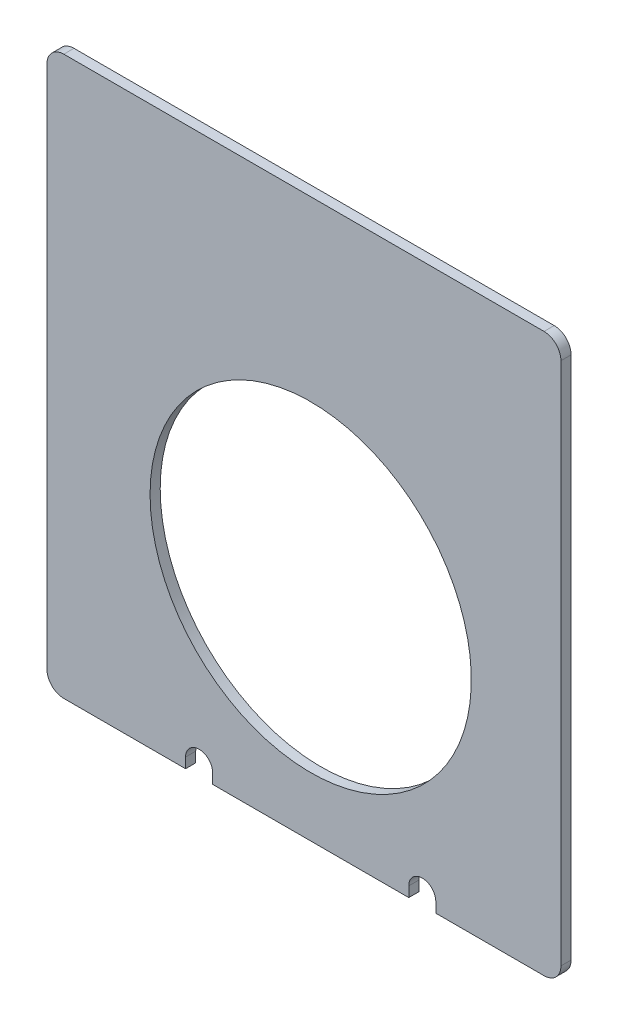
ISO-10303-21;
HEADER;
FILE_DESCRIPTION(('STEP AP214'),'2;1');
FILE_NAME('part.step','',(''),(''),'','','');
FILE_SCHEMA(('AUTOMOTIVE_DESIGN { 1 0 10303 214 1 1 1 1 }'));
ENDSEC;
DATA;
#1=APPLICATION_CONTEXT('core data for automotive mechanical design processes');
#2=APPLICATION_PROTOCOL_DEFINITION('international standard','automotive_design',2000,#1);
#3=PRODUCT_CONTEXT('',#1,'mechanical');
#4=PRODUCT('Part','Part','',(#3));
#5=PRODUCT_RELATED_PRODUCT_CATEGORY('part','',(#4));
#6=PRODUCT_DEFINITION_FORMATION('','',#4);
#7=PRODUCT_DEFINITION_CONTEXT('part definition',#1,'design');
#8=PRODUCT_DEFINITION('design','',#6,#7);
#9=PRODUCT_DEFINITION_SHAPE('','',#8);
#10=(LENGTH_UNIT() NAMED_UNIT(*) SI_UNIT(.MILLI.,.METRE.));
#11=(NAMED_UNIT(*) PLANE_ANGLE_UNIT() SI_UNIT($,.RADIAN.));
#12=(NAMED_UNIT(*) SI_UNIT($,.STERADIAN.) SOLID_ANGLE_UNIT());
#13=UNCERTAINTY_MEASURE_WITH_UNIT(LENGTH_MEASURE(1.E-05),#10,'distance_accuracy_value','');
#14=(GEOMETRIC_REPRESENTATION_CONTEXT(3) GLOBAL_UNCERTAINTY_ASSIGNED_CONTEXT((#13)) GLOBAL_UNIT_ASSIGNED_CONTEXT((#10,
#11,#12)) REPRESENTATION_CONTEXT('',''));
#15=CARTESIAN_POINT('',(0.,0.,0.));
#16=DIRECTION('',(0.,0.,1.));
#17=DIRECTION('',(1.,0.,0.));
#18=AXIS2_PLACEMENT_3D('',#15,#16,#17);
#19=CARTESIAN_POINT('',(0.,0.,3.));
#20=DIRECTION('',(0.,1.,0.));
#21=DIRECTION('',(-1.,0.,0.));
#22=AXIS2_PLACEMENT_3D('',#19,#20,#21);
#23=PLANE('',#22);
#24=DIRECTION('',(1.,0.,0.));
#25=VECTOR('',#24,1.);
#26=CARTESIAN_POINT('',(0.,0.,3.));
#27=LINE('',#26,#25);
#28=CARTESIAN_POINT('',(-103.,0.,3.));
#29=VERTEX_POINT('',#28);
#30=CARTESIAN_POINT('',(-45.,0.,3.));
#31=VERTEX_POINT('',#30);
#32=EDGE_CURVE('E225',#29,#31,#27,.T.);
#33=ORIENTED_EDGE('',*,*,#32,.F.);
#34=DIRECTION('',(0.,0.,-1.));
#35=VECTOR('',#34,1.);
#36=CARTESIAN_POINT('',(-103.,0.,3.));
#37=LINE('',#36,#35);
#38=CARTESIAN_POINT('',(-103.,0.,0.));
#39=VERTEX_POINT('',#38);
#40=EDGE_CURVE('E179',#29,#39,#37,.T.);
#41=ORIENTED_EDGE('',*,*,#40,.T.);
#42=DIRECTION('',(1.,0.,0.));
#43=VECTOR('',#42,1.);
#44=CARTESIAN_POINT('',(0.,0.,0.));
#45=LINE('',#44,#43);
#46=CARTESIAN_POINT('',(-45.,0.,0.));
#47=VERTEX_POINT('',#46);
#48=EDGE_CURVE('E57',#39,#47,#45,.T.);
#49=ORIENTED_EDGE('',*,*,#48,.T.);
#50=DIRECTION('',(0.,0.,1.));
#51=VECTOR('',#50,1.);
#52=CARTESIAN_POINT('',(-45.,0.,3.));
#53=LINE('',#52,#51);
#54=EDGE_CURVE('E198',#47,#31,#53,.T.);
#55=ORIENTED_EDGE('',*,*,#54,.T.);
#56=EDGE_LOOP('',(#33,#41,#49,#55));
#57=FACE_BOUND('',#56,.T.);
#58=ADVANCED_FACE('F35',(#57),#23,.F.);
#59=CARTESIAN_POINT('',(-37.,0.,3.));
#60=VERTEX_POINT('',#59);
#61=CARTESIAN_POINT('',(-5.,0.,3.));
#62=VERTEX_POINT('',#61);
#63=EDGE_CURVE('E222',#60,#62,#27,.T.);
#64=ORIENTED_EDGE('',*,*,#63,.F.);
#65=DIRECTION('',(0.,0.,-1.));
#66=VECTOR('',#65,1.);
#67=CARTESIAN_POINT('',(-37.,0.,3.));
#68=LINE('',#67,#66);
#69=CARTESIAN_POINT('',(-37.,0.,0.));
#70=VERTEX_POINT('',#69);
#71=EDGE_CURVE('E202',#60,#70,#68,.T.);
#72=ORIENTED_EDGE('',*,*,#71,.T.);
#73=CARTESIAN_POINT('',(-5.,0.,0.));
#74=VERTEX_POINT('',#73);
#75=EDGE_CURVE('E234',#70,#74,#45,.T.);
#76=ORIENTED_EDGE('',*,*,#75,.T.);
#77=DIRECTION('',(0.,0.,-1.));
#78=VECTOR('',#77,1.);
#79=CARTESIAN_POINT('',(-5.,0.,3.));
#80=LINE('',#79,#78);
#81=EDGE_CURVE('E253',#74,#62,#80,.F.);
#82=ORIENTED_EDGE('',*,*,#81,.T.);
#83=EDGE_LOOP('',(#64,#72,#76,#82));
#84=FACE_BOUND('',#83,.T.);
#85=ADVANCED_FACE('F292',(#84),#23,.F.);
#86=CARTESIAN_POINT('',(0.,0.,3.));
#87=DIRECTION('',(-1.,0.,0.));
#88=DIRECTION('',(0.,-1.,0.));
#89=AXIS2_PLACEMENT_3D('',#86,#87,#88);
#90=PLANE('',#89);
#91=DIRECTION('',(0.,1.,0.));
#92=VECTOR('',#91,1.);
#93=CARTESIAN_POINT('',(0.,0.,3.));
#94=LINE('',#93,#92);
#95=CARTESIAN_POINT('',(0.,5.,3.));
#96=VERTEX_POINT('',#95);
#97=CARTESIAN_POINT('',(0.,160.,3.));
#98=VERTEX_POINT('',#97);
#99=EDGE_CURVE('E212',#96,#98,#94,.T.);
#100=ORIENTED_EDGE('',*,*,#99,.F.);
#101=DIRECTION('',(0.,0.,-1.));
#102=VECTOR('',#101,1.);
#103=CARTESIAN_POINT('',(0.,5.,3.));
#104=LINE('',#103,#102);
#105=CARTESIAN_POINT('',(0.,5.,0.));
#106=VERTEX_POINT('',#105);
#107=EDGE_CURVE('E238',#96,#106,#104,.T.);
#108=ORIENTED_EDGE('',*,*,#107,.T.);
#109=DIRECTION('',(0.,1.,0.));
#110=VECTOR('',#109,1.);
#111=CARTESIAN_POINT('',(0.,0.,0.));
#112=LINE('',#111,#110);
#113=CARTESIAN_POINT('',(0.,160.,0.));
#114=VERTEX_POINT('',#113);
#115=EDGE_CURVE('E209',#106,#114,#112,.T.);
#116=ORIENTED_EDGE('',*,*,#115,.T.);
#117=DIRECTION('',(0.,0.,-1.));
#118=VECTOR('',#117,1.);
#119=CARTESIAN_POINT('',(0.,160.,3.));
#120=LINE('',#119,#118);
#121=EDGE_CURVE('E224',#114,#98,#120,.F.);
#122=ORIENTED_EDGE('',*,*,#121,.T.);
#123=EDGE_LOOP('',(#100,#108,#116,#122));
#124=FACE_BOUND('',#123,.T.);
#125=ADVANCED_FACE('F299',(#124),#90,.F.);
#126=CARTESIAN_POINT('',(0.,165.,3.));
#127=DIRECTION('',(0.,-1.,0.));
#128=DIRECTION('',(1.,0.,0.));
#129=AXIS2_PLACEMENT_3D('',#126,#127,#128);
#130=PLANE('',#129);
#131=DIRECTION('',(-1.,0.,0.));
#132=VECTOR('',#131,1.);
#133=CARTESIAN_POINT('',(0.,165.,0.));
#134=LINE('',#133,#132);
#135=CARTESIAN_POINT('',(-5.,165.,0.));
#136=VERTEX_POINT('',#135);
#137=CARTESIAN_POINT('',(-147.,165.,0.));
#138=VERTEX_POINT('',#137);
#139=EDGE_CURVE('E228',#136,#138,#134,.T.);
#140=ORIENTED_EDGE('',*,*,#139,.T.);
#141=DIRECTION('',(0.,0.,-1.));
#142=VECTOR('',#141,1.);
#143=CARTESIAN_POINT('',(-147.,165.,3.));
#144=LINE('',#143,#142);
#145=CARTESIAN_POINT('',(-147.,165.,3.));
#146=VERTEX_POINT('',#145);
#147=EDGE_CURVE('E272',#138,#146,#144,.F.);
#148=ORIENTED_EDGE('',*,*,#147,.T.);
#149=DIRECTION('',(-1.,0.,0.));
#150=VECTOR('',#149,1.);
#151=CARTESIAN_POINT('',(0.,165.,3.));
#152=LINE('',#151,#150);
#153=CARTESIAN_POINT('',(-5.,165.,3.));
#154=VERTEX_POINT('',#153);
#155=EDGE_CURVE('E215',#154,#146,#152,.T.);
#156=ORIENTED_EDGE('',*,*,#155,.F.);
#157=DIRECTION('',(0.,0.,-1.));
#158=VECTOR('',#157,1.);
#159=CARTESIAN_POINT('',(-5.,165.,3.));
#160=LINE('',#159,#158);
#161=EDGE_CURVE('E269',#154,#136,#160,.T.);
#162=ORIENTED_EDGE('',*,*,#161,.T.);
#163=EDGE_LOOP('',(#140,#148,#156,#162));
#164=FACE_BOUND('',#163,.T.);
#165=ADVANCED_FACE('F307',(#164),#130,.F.);
#166=CARTESIAN_POINT('',(-152.,0.,3.));
#167=DIRECTION('',(1.,0.,0.));
#168=DIRECTION('',(0.,0.,-1.));
#169=AXIS2_PLACEMENT_3D('',#166,#167,#168);
#170=PLANE('',#169);
#171=DIRECTION('',(0.,-1.,0.));
#172=VECTOR('',#171,1.);
#173=CARTESIAN_POINT('',(-152.,0.,0.));
#174=LINE('',#173,#172);
#175=CARTESIAN_POINT('',(-152.,160.,0.));
#176=VERTEX_POINT('',#175);
#177=CARTESIAN_POINT('',(-152.,4.99999999999998,0.));
#178=VERTEX_POINT('',#177);
#179=EDGE_CURVE('E231',#176,#178,#174,.T.);
#180=ORIENTED_EDGE('',*,*,#179,.T.);
#181=DIRECTION('',(0.,0.,-1.));
#182=VECTOR('',#181,1.);
#183=CARTESIAN_POINT('',(-152.,4.99999999999998,3.));
#184=LINE('',#183,#182);
#185=CARTESIAN_POINT('',(-152.,4.99999999999998,3.));
#186=VERTEX_POINT('',#185);
#187=EDGE_CURVE('E267',#178,#186,#184,.F.);
#188=ORIENTED_EDGE('',*,*,#187,.T.);
#189=DIRECTION('',(0.,-1.,0.));
#190=VECTOR('',#189,1.);
#191=CARTESIAN_POINT('',(-152.,0.,3.));
#192=LINE('',#191,#190);
#193=CARTESIAN_POINT('',(-152.,160.,3.));
#194=VERTEX_POINT('',#193);
#195=EDGE_CURVE('E219',#194,#186,#192,.T.);
#196=ORIENTED_EDGE('',*,*,#195,.F.);
#197=DIRECTION('',(0.,0.,-1.));
#198=VECTOR('',#197,1.);
#199=CARTESIAN_POINT('',(-152.,160.,3.));
#200=LINE('',#199,#198);
#201=EDGE_CURVE('E264',#194,#176,#200,.T.);
#202=ORIENTED_EDGE('',*,*,#201,.T.);
#203=EDGE_LOOP('',(#180,#188,#196,#202));
#204=FACE_BOUND('',#203,.T.);
#205=ADVANCED_FACE('F316',(#204),#170,.F.);
#206=CARTESIAN_POINT('',(-147.,0.,0.));
#207=VERTEX_POINT('',#206);
#208=CARTESIAN_POINT('',(-111.,0.,0.));
#209=VERTEX_POINT('',#208);
#210=EDGE_CURVE('E216',#207,#209,#45,.T.);
#211=ORIENTED_EDGE('',*,*,#210,.T.);
#212=DIRECTION('',(0.,0.,1.));
#213=VECTOR('',#212,1.);
#214=CARTESIAN_POINT('',(-111.,0.,3.));
#215=LINE('',#214,#213);
#216=CARTESIAN_POINT('',(-111.,0.,3.));
#217=VERTEX_POINT('',#216);
#218=EDGE_CURVE('E50',#209,#217,#215,.T.);
#219=ORIENTED_EDGE('',*,*,#218,.T.);
#220=CARTESIAN_POINT('',(-147.,0.,3.));
#221=VERTEX_POINT('',#220);
#222=EDGE_CURVE('E169',#221,#217,#27,.T.);
#223=ORIENTED_EDGE('',*,*,#222,.F.);
#224=DIRECTION('',(0.,0.,-1.));
#225=VECTOR('',#224,1.);
#226=CARTESIAN_POINT('',(-147.,0.,3.));
#227=LINE('',#226,#225);
#228=EDGE_CURVE('E250',#221,#207,#227,.T.);
#229=ORIENTED_EDGE('',*,*,#228,.T.);
#230=EDGE_LOOP('',(#211,#219,#223,#229));
#231=FACE_BOUND('',#230,.T.);
#232=ADVANCED_FACE('F324',(#231),#23,.F.);
#233=CARTESIAN_POINT('',(0.,0.,3.));
#234=DIRECTION('',(0.,0.,1.));
#235=DIRECTION('',(1.,0.,0.));
#236=AXIS2_PLACEMENT_3D('',#233,#234,#235);
#237=PLANE('',#236);
#238=DIRECTION('',(0.,-1.,0.));
#239=VECTOR('',#238,1.);
#240=CARTESIAN_POINT('',(-103.,-3.00000000000002,3.));
#241=LINE('',#240,#239);
#242=CARTESIAN_POINT('',(-103.,2.99999999999998,3.));
#243=VERTEX_POINT('',#242);
#244=EDGE_CURVE('E156',#243,#29,#241,.T.);
#245=ORIENTED_EDGE('',*,*,#244,.T.);
#246=ORIENTED_EDGE('',*,*,#32,.T.);
#247=DIRECTION('',(0.,1.,0.));
#248=VECTOR('',#247,1.);
#249=CARTESIAN_POINT('',(-45.,-3.,3.));
#250=LINE('',#249,#248);
#251=CARTESIAN_POINT('',(-45.,3.,3.));
#252=VERTEX_POINT('',#251);
#253=EDGE_CURVE('E182',#31,#252,#250,.T.);
#254=ORIENTED_EDGE('',*,*,#253,.T.);
#255=CARTESIAN_POINT('',(-41.,3.,3.));
#256=DIRECTION('',(0.,0.,-1.));
#257=DIRECTION('',(-1.,0.,0.));
#258=AXIS2_PLACEMENT_3D('',#255,#256,#257);
#259=CIRCLE('',#258,4.);
#260=CARTESIAN_POINT('',(-37.,3.,3.));
#261=VERTEX_POINT('',#260);
#262=EDGE_CURVE('E185',#252,#261,#259,.T.);
#263=ORIENTED_EDGE('',*,*,#262,.T.);
#264=DIRECTION('',(0.,-1.,0.));
#265=VECTOR('',#264,1.);
#266=CARTESIAN_POINT('',(-37.,-3.,3.));
#267=LINE('',#266,#265);
#268=EDGE_CURVE('E189',#261,#60,#267,.T.);
#269=ORIENTED_EDGE('',*,*,#268,.T.);
#270=ORIENTED_EDGE('',*,*,#63,.T.);
#271=CARTESIAN_POINT('',(-5.,5.,3.));
#272=DIRECTION('',(0.,0.,1.));
#273=DIRECTION('',(1.,0.,0.));
#274=AXIS2_PLACEMENT_3D('',#271,#272,#273);
#275=CIRCLE('',#274,5.);
#276=EDGE_CURVE('E262',#62,#96,#275,.T.);
#277=ORIENTED_EDGE('',*,*,#276,.T.);
#278=ORIENTED_EDGE('',*,*,#99,.T.);
#279=CARTESIAN_POINT('',(-5.,160.,3.));
#280=DIRECTION('',(0.,0.,1.));
#281=DIRECTION('',(1.,0.,0.));
#282=AXIS2_PLACEMENT_3D('',#279,#280,#281);
#283=CIRCLE('',#282,5.);
#284=EDGE_CURVE('E256',#98,#154,#283,.T.);
#285=ORIENTED_EDGE('',*,*,#284,.T.);
#286=ORIENTED_EDGE('',*,*,#155,.T.);
#287=CARTESIAN_POINT('',(-147.,160.,3.));
#288=DIRECTION('',(0.,0.,1.));
#289=DIRECTION('',(1.,0.,0.));
#290=AXIS2_PLACEMENT_3D('',#287,#288,#289);
#291=CIRCLE('',#290,5.);
#292=EDGE_CURVE('E258',#146,#194,#291,.T.);
#293=ORIENTED_EDGE('',*,*,#292,.T.);
#294=ORIENTED_EDGE('',*,*,#195,.T.);
#295=CARTESIAN_POINT('',(-147.,4.99999999999998,3.));
#296=DIRECTION('',(0.,0.,1.));
#297=DIRECTION('',(1.,0.,0.));
#298=AXIS2_PLACEMENT_3D('',#295,#296,#297);
#299=CIRCLE('',#298,5.);
#300=EDGE_CURVE('E260',#186,#221,#299,.T.);
#301=ORIENTED_EDGE('',*,*,#300,.T.);
#302=ORIENTED_EDGE('',*,*,#222,.T.);
#303=DIRECTION('',(0.,1.,0.));
#304=VECTOR('',#303,1.);
#305=CARTESIAN_POINT('',(-111.,-3.00000000000002,3.));
#306=LINE('',#305,#304);
#307=CARTESIAN_POINT('',(-111.,2.99999999999998,3.));
#308=VERTEX_POINT('',#307);
#309=EDGE_CURVE('E151',#217,#308,#306,.T.);
#310=ORIENTED_EDGE('',*,*,#309,.T.);
#311=CARTESIAN_POINT('',(-107.,2.99999999999998,3.));
#312=DIRECTION('',(0.,0.,-1.));
#313=DIRECTION('',(-1.,0.,0.));
#314=AXIS2_PLACEMENT_3D('',#311,#312,#313);
#315=CIRCLE('',#314,3.99999999999999);
#316=EDGE_CURVE('E159',#308,#243,#315,.T.);
#317=ORIENTED_EDGE('',*,*,#316,.T.);
#318=EDGE_LOOP('',(#245,#246,#254,#263,#269,#270,#277,#278,#285,#286,#293,#294,#301,#302,#310,#317));
#319=FACE_BOUND('',#318,.T.);
#320=CARTESIAN_POINT('',(-74.,65.,3.));
#321=DIRECTION('',(0.,0.,-1.));
#322=DIRECTION('',(-1.,0.,0.));
#323=AXIS2_PLACEMENT_3D('',#320,#321,#322);
#324=CIRCLE('',#323,47.5);
#325=CARTESIAN_POINT('',(-121.5,65.,3.));
#326=VERTEX_POINT('',#325);
#327=EDGE_CURVE('E206',#326,#326,#324,.T.);
#328=ORIENTED_EDGE('',*,*,#327,.T.);
#329=EDGE_LOOP('',(#328));
#330=FACE_BOUND('',#329,.T.);
#331=ADVANCED_FACE('F166',(#319,#330),#237,.T.);
#332=CARTESIAN_POINT('',(0.,0.,0.));
#333=DIRECTION('',(0.,0.,1.));
#334=DIRECTION('',(1.,0.,0.));
#335=AXIS2_PLACEMENT_3D('',#332,#333,#334);
#336=PLANE('',#335);
#337=CARTESIAN_POINT('',(-74.,65.,0.));
#338=DIRECTION('',(0.,0.,-1.));
#339=DIRECTION('',(-1.,0.,0.));
#340=AXIS2_PLACEMENT_3D('',#337,#338,#339);
#341=CIRCLE('',#340,47.5);
#342=CARTESIAN_POINT('',(-121.5,65.,0.));
#343=VERTEX_POINT('',#342);
#344=EDGE_CURVE('E205',#343,#343,#341,.T.);
#345=ORIENTED_EDGE('',*,*,#344,.F.);
#346=EDGE_LOOP('',(#345));
#347=FACE_BOUND('',#346,.T.);
#348=ORIENTED_EDGE('',*,*,#48,.F.);
#349=DIRECTION('',(0.,-1.,0.));
#350=VECTOR('',#349,1.);
#351=CARTESIAN_POINT('',(-103.,-3.00000000000002,0.));
#352=LINE('',#351,#350);
#353=CARTESIAN_POINT('',(-103.,2.99999999999998,0.));
#354=VERTEX_POINT('',#353);
#355=EDGE_CURVE('E170',#354,#39,#352,.T.);
#356=ORIENTED_EDGE('',*,*,#355,.F.);
#357=CARTESIAN_POINT('',(-107.,2.99999999999998,0.));
#358=DIRECTION('',(0.,0.,-1.));
#359=DIRECTION('',(-1.,0.,0.));
#360=AXIS2_PLACEMENT_3D('',#357,#358,#359);
#361=CIRCLE('',#360,3.99999999999999);
#362=CARTESIAN_POINT('',(-111.,2.99999999999998,0.));
#363=VERTEX_POINT('',#362);
#364=EDGE_CURVE('E172',#363,#354,#361,.T.);
#365=ORIENTED_EDGE('',*,*,#364,.F.);
#366=DIRECTION('',(0.,-1.,0.));
#367=VECTOR('',#366,1.);
#368=CARTESIAN_POINT('',(-111.,0.,0.));
#369=LINE('',#368,#367);
#370=EDGE_CURVE('E11',#363,#209,#369,.T.);
#371=ORIENTED_EDGE('',*,*,#370,.T.);
#372=ORIENTED_EDGE('',*,*,#210,.F.);
#373=CARTESIAN_POINT('',(-147.,4.99999999999998,0.));
#374=DIRECTION('',(0.,0.,1.));
#375=DIRECTION('',(1.,0.,0.));
#376=AXIS2_PLACEMENT_3D('',#373,#374,#375);
#377=CIRCLE('',#376,5.);
#378=EDGE_CURVE('E245',#207,#178,#377,.F.);
#379=ORIENTED_EDGE('',*,*,#378,.T.);
#380=ORIENTED_EDGE('',*,*,#179,.F.);
#381=CARTESIAN_POINT('',(-147.,160.,0.));
#382=DIRECTION('',(0.,0.,1.));
#383=DIRECTION('',(1.,0.,0.));
#384=AXIS2_PLACEMENT_3D('',#381,#382,#383);
#385=CIRCLE('',#384,5.);
#386=EDGE_CURVE('E243',#176,#138,#385,.F.);
#387=ORIENTED_EDGE('',*,*,#386,.T.);
#388=ORIENTED_EDGE('',*,*,#139,.F.);
#389=CARTESIAN_POINT('',(-5.,160.,0.));
#390=DIRECTION('',(0.,0.,1.));
#391=DIRECTION('',(1.,0.,0.));
#392=AXIS2_PLACEMENT_3D('',#389,#390,#391);
#393=CIRCLE('',#392,5.);
#394=EDGE_CURVE('E241',#136,#114,#393,.F.);
#395=ORIENTED_EDGE('',*,*,#394,.T.);
#396=ORIENTED_EDGE('',*,*,#115,.F.);
#397=CARTESIAN_POINT('',(-5.,5.,0.));
#398=DIRECTION('',(0.,0.,1.));
#399=DIRECTION('',(1.,0.,0.));
#400=AXIS2_PLACEMENT_3D('',#397,#398,#399);
#401=CIRCLE('',#400,5.);
#402=EDGE_CURVE('E247',#106,#74,#401,.F.);
#403=ORIENTED_EDGE('',*,*,#402,.T.);
#404=ORIENTED_EDGE('',*,*,#75,.F.);
#405=DIRECTION('',(0.,-1.,0.));
#406=VECTOR('',#405,1.);
#407=CARTESIAN_POINT('',(-37.,-3.,0.));
#408=LINE('',#407,#406);
#409=CARTESIAN_POINT('',(-37.,3.,0.));
#410=VERTEX_POINT('',#409);
#411=EDGE_CURVE('E186',#410,#70,#408,.T.);
#412=ORIENTED_EDGE('',*,*,#411,.F.);
#413=CARTESIAN_POINT('',(-41.,3.,0.));
#414=DIRECTION('',(0.,0.,-1.));
#415=DIRECTION('',(-1.,0.,0.));
#416=AXIS2_PLACEMENT_3D('',#413,#414,#415);
#417=CIRCLE('',#416,4.);
#418=CARTESIAN_POINT('',(-45.,3.,0.));
#419=VERTEX_POINT('',#418);
#420=EDGE_CURVE('E181',#419,#410,#417,.T.);
#421=ORIENTED_EDGE('',*,*,#420,.F.);
#422=DIRECTION('',(0.,-1.,0.));
#423=VECTOR('',#422,1.);
#424=CARTESIAN_POINT('',(-45.,0.,0.));
#425=LINE('',#424,#423);
#426=EDGE_CURVE('E43',#419,#47,#425,.T.);
#427=ORIENTED_EDGE('',*,*,#426,.T.);
#428=EDGE_LOOP('',(#348,#356,#365,#371,#372,#379,#380,#387,#388,#395,#396,#403,#404,#412,#421,#427));
#429=FACE_BOUND('',#428,.T.);
#430=ADVANCED_FACE('F276',(#347,#429),#336,.F.);
#431=CARTESIAN_POINT('',(-5.,5.,3.));
#432=DIRECTION('',(0.,0.,-1.));
#433=DIRECTION('',(-1.,0.,0.));
#434=AXIS2_PLACEMENT_3D('',#431,#432,#433);
#435=CYLINDRICAL_SURFACE('',#434,5.);
#436=ORIENTED_EDGE('',*,*,#276,.F.);
#437=ORIENTED_EDGE('',*,*,#81,.F.);
#438=ORIENTED_EDGE('',*,*,#402,.F.);
#439=ORIENTED_EDGE('',*,*,#107,.F.);
#440=EDGE_LOOP('',(#436,#437,#438,#439));
#441=FACE_BOUND('',#440,.T.);
#442=ADVANCED_FACE('F296',(#441),#435,.T.);
#443=CARTESIAN_POINT('',(-147.,4.99999999999998,3.));
#444=DIRECTION('',(0.,0.,-1.));
#445=DIRECTION('',(-1.,0.,0.));
#446=AXIS2_PLACEMENT_3D('',#443,#444,#445);
#447=CYLINDRICAL_SURFACE('',#446,5.);
#448=ORIENTED_EDGE('',*,*,#300,.F.);
#449=ORIENTED_EDGE('',*,*,#187,.F.);
#450=ORIENTED_EDGE('',*,*,#378,.F.);
#451=ORIENTED_EDGE('',*,*,#228,.F.);
#452=EDGE_LOOP('',(#448,#449,#450,#451));
#453=FACE_BOUND('',#452,.T.);
#454=ADVANCED_FACE('F322',(#453),#447,.T.);
#455=CARTESIAN_POINT('',(-147.,160.,3.));
#456=DIRECTION('',(0.,0.,-1.));
#457=DIRECTION('',(-1.,0.,0.));
#458=AXIS2_PLACEMENT_3D('',#455,#456,#457);
#459=CYLINDRICAL_SURFACE('',#458,5.);
#460=ORIENTED_EDGE('',*,*,#292,.F.);
#461=ORIENTED_EDGE('',*,*,#147,.F.);
#462=ORIENTED_EDGE('',*,*,#386,.F.);
#463=ORIENTED_EDGE('',*,*,#201,.F.);
#464=EDGE_LOOP('',(#460,#461,#462,#463));
#465=FACE_BOUND('',#464,.T.);
#466=ADVANCED_FACE('F313',(#465),#459,.T.);
#467=CARTESIAN_POINT('',(-5.,160.,3.));
#468=DIRECTION('',(0.,0.,-1.));
#469=DIRECTION('',(-1.,0.,0.));
#470=AXIS2_PLACEMENT_3D('',#467,#468,#469);
#471=CYLINDRICAL_SURFACE('',#470,5.);
#472=ORIENTED_EDGE('',*,*,#284,.F.);
#473=ORIENTED_EDGE('',*,*,#121,.F.);
#474=ORIENTED_EDGE('',*,*,#394,.F.);
#475=ORIENTED_EDGE('',*,*,#161,.F.);
#476=EDGE_LOOP('',(#472,#473,#474,#475));
#477=FACE_BOUND('',#476,.T.);
#478=ADVANCED_FACE('F37',(#477),#471,.T.);
#479=CARTESIAN_POINT('',(-74.,65.,3.));
#480=DIRECTION('',(0.,0.,-1.));
#481=DIRECTION('',(-1.,0.,0.));
#482=AXIS2_PLACEMENT_3D('',#479,#480,#481);
#483=CYLINDRICAL_SURFACE('',#482,47.5);
#484=ORIENTED_EDGE('',*,*,#327,.F.);
#485=EDGE_LOOP('',(#484));
#486=FACE_BOUND('',#485,.T.);
#487=ORIENTED_EDGE('',*,*,#344,.T.);
#488=EDGE_LOOP('',(#487));
#489=FACE_BOUND('',#488,.T.);
#490=ADVANCED_FACE('F352',(#486,#489),#483,.F.);
#491=CARTESIAN_POINT('',(-37.,-3.,3.));
#492=DIRECTION('',(1.,0.,0.));
#493=DIRECTION('',(0.,0.,-1.));
#494=AXIS2_PLACEMENT_3D('',#491,#492,#493);
#495=PLANE('',#494);
#496=ORIENTED_EDGE('',*,*,#268,.F.);
#497=DIRECTION('',(0.,0.,-1.));
#498=VECTOR('',#497,1.);
#499=CARTESIAN_POINT('',(-37.,3.,3.));
#500=LINE('',#499,#498);
#501=EDGE_CURVE('E196',#261,#410,#500,.T.);
#502=ORIENTED_EDGE('',*,*,#501,.T.);
#503=ORIENTED_EDGE('',*,*,#411,.T.);
#504=ORIENTED_EDGE('',*,*,#71,.F.);
#505=EDGE_LOOP('',(#496,#502,#503,#504));
#506=FACE_BOUND('',#505,.T.);
#507=ADVANCED_FACE('F356',(#506),#495,.F.);
#508=CARTESIAN_POINT('',(-45.,-3.,3.));
#509=DIRECTION('',(-1.,0.,0.));
#510=DIRECTION('',(0.,0.,1.));
#511=AXIS2_PLACEMENT_3D('',#508,#509,#510);
#512=PLANE('',#511);
#513=ORIENTED_EDGE('',*,*,#426,.F.);
#514=DIRECTION('',(0.,0.,-1.));
#515=VECTOR('',#514,1.);
#516=CARTESIAN_POINT('',(-45.,3.,3.));
#517=LINE('',#516,#515);
#518=EDGE_CURVE('E192',#252,#419,#517,.T.);
#519=ORIENTED_EDGE('',*,*,#518,.F.);
#520=ORIENTED_EDGE('',*,*,#253,.F.);
#521=ORIENTED_EDGE('',*,*,#54,.F.);
#522=EDGE_LOOP('',(#513,#519,#520,#521));
#523=FACE_BOUND('',#522,.T.);
#524=ADVANCED_FACE('F280',(#523),#512,.F.);
#525=CARTESIAN_POINT('',(-41.,3.,3.));
#526=DIRECTION('',(0.,0.,-1.));
#527=DIRECTION('',(-1.,0.,0.));
#528=AXIS2_PLACEMENT_3D('',#525,#526,#527);
#529=CYLINDRICAL_SURFACE('',#528,4.);
#530=ORIENTED_EDGE('',*,*,#420,.T.);
#531=ORIENTED_EDGE('',*,*,#501,.F.);
#532=ORIENTED_EDGE('',*,*,#262,.F.);
#533=ORIENTED_EDGE('',*,*,#518,.T.);
#534=EDGE_LOOP('',(#530,#531,#532,#533));
#535=FACE_BOUND('',#534,.T.);
#536=ADVANCED_FACE('F284',(#535),#529,.F.);
#537=CARTESIAN_POINT('',(-103.,-3.00000000000002,3.));
#538=DIRECTION('',(1.,0.,0.));
#539=DIRECTION('',(0.,0.,-1.));
#540=AXIS2_PLACEMENT_3D('',#537,#538,#539);
#541=PLANE('',#540);
#542=ORIENTED_EDGE('',*,*,#244,.F.);
#543=DIRECTION('',(0.,0.,-1.));
#544=VECTOR('',#543,1.);
#545=CARTESIAN_POINT('',(-103.,2.99999999999998,3.));
#546=LINE('',#545,#544);
#547=EDGE_CURVE('E155',#243,#354,#546,.T.);
#548=ORIENTED_EDGE('',*,*,#547,.T.);
#549=ORIENTED_EDGE('',*,*,#355,.T.);
#550=ORIENTED_EDGE('',*,*,#40,.F.);
#551=EDGE_LOOP('',(#542,#548,#549,#550));
#552=FACE_BOUND('',#551,.T.);
#553=ADVANCED_FACE('F454',(#552),#541,.F.);
#554=CARTESIAN_POINT('',(-111.,-3.00000000000002,3.));
#555=DIRECTION('',(-1.,0.,0.));
#556=DIRECTION('',(0.,0.,1.));
#557=AXIS2_PLACEMENT_3D('',#554,#555,#556);
#558=PLANE('',#557);
#559=ORIENTED_EDGE('',*,*,#370,.F.);
#560=DIRECTION('',(0.,0.,-1.));
#561=VECTOR('',#560,1.);
#562=CARTESIAN_POINT('',(-111.,2.99999999999998,3.));
#563=LINE('',#562,#561);
#564=EDGE_CURVE('E147',#308,#363,#563,.T.);
#565=ORIENTED_EDGE('',*,*,#564,.F.);
#566=ORIENTED_EDGE('',*,*,#309,.F.);
#567=ORIENTED_EDGE('',*,*,#218,.F.);
#568=EDGE_LOOP('',(#559,#565,#566,#567));
#569=FACE_BOUND('',#568,.T.);
#570=ADVANCED_FACE('F149',(#569),#558,.F.);
#571=CARTESIAN_POINT('',(-107.,2.99999999999998,3.));
#572=DIRECTION('',(0.,0.,-1.));
#573=DIRECTION('',(-1.,0.,0.));
#574=AXIS2_PLACEMENT_3D('',#571,#572,#573);
#575=CYLINDRICAL_SURFACE('',#574,3.99999999999999);
#576=ORIENTED_EDGE('',*,*,#364,.T.);
#577=ORIENTED_EDGE('',*,*,#547,.F.);
#578=ORIENTED_EDGE('',*,*,#316,.F.);
#579=ORIENTED_EDGE('',*,*,#564,.T.);
#580=EDGE_LOOP('',(#576,#577,#578,#579));
#581=FACE_BOUND('',#580,.T.);
#582=ADVANCED_FACE('F160',(#581),#575,.F.);
#583=CLOSED_SHELL('',(#58,#85,#125,#165,#205,#232,#331,#430,#442,#454,#466,#478,#490,#507,#524,
#536,#553,#570,#582));
#584=MANIFOLD_SOLID_BREP('B2',#583);
#585=ADVANCED_BREP_SHAPE_REPRESENTATION('',(#18,#584),#14);
#586=SHAPE_DEFINITION_REPRESENTATION(#9,#585);
ENDSEC;
END-ISO-10303-21;
